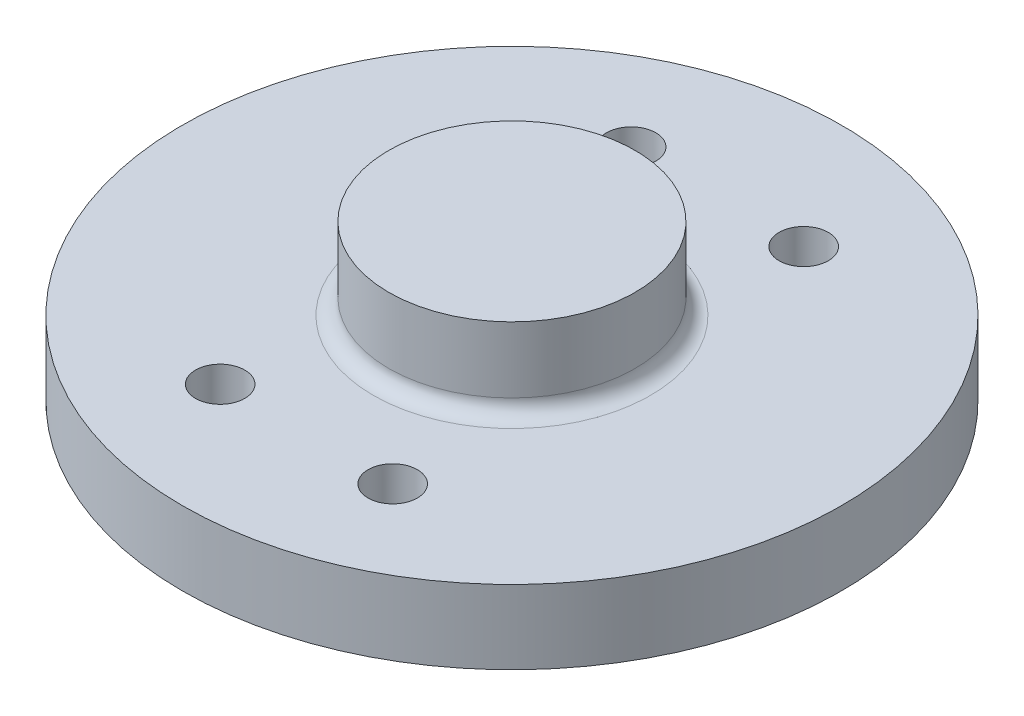
ISO-10303-21;
HEADER;
FILE_DESCRIPTION(('STEP AP214'),'2;1');
FILE_NAME('part.step','',(''),(''),'','','');
FILE_SCHEMA(('AUTOMOTIVE_DESIGN { 1 0 10303 214 1 1 1 1 }'));
ENDSEC;
DATA;
#1=APPLICATION_CONTEXT('core data for automotive mechanical design processes');
#2=APPLICATION_PROTOCOL_DEFINITION('international standard','automotive_design',2000,#1);
#3=PRODUCT_CONTEXT('',#1,'mechanical');
#4=PRODUCT('Part','Part','',(#3));
#5=PRODUCT_RELATED_PRODUCT_CATEGORY('part','',(#4));
#6=PRODUCT_DEFINITION_FORMATION('','',#4);
#7=PRODUCT_DEFINITION_CONTEXT('part definition',#1,'design');
#8=PRODUCT_DEFINITION('design','',#6,#7);
#9=PRODUCT_DEFINITION_SHAPE('','',#8);
#10=(LENGTH_UNIT() NAMED_UNIT(*) SI_UNIT(.MILLI.,.METRE.));
#11=(NAMED_UNIT(*) PLANE_ANGLE_UNIT() SI_UNIT($,.RADIAN.));
#12=(NAMED_UNIT(*) SI_UNIT($,.STERADIAN.) SOLID_ANGLE_UNIT());
#13=UNCERTAINTY_MEASURE_WITH_UNIT(LENGTH_MEASURE(1.E-05),#10,'distance_accuracy_value','');
#14=(GEOMETRIC_REPRESENTATION_CONTEXT(3) GLOBAL_UNCERTAINTY_ASSIGNED_CONTEXT((#13)) GLOBAL_UNIT_ASSIGNED_CONTEXT((#10,
#11,#12)) REPRESENTATION_CONTEXT('',''));
#15=CARTESIAN_POINT('',(0.,0.,0.));
#16=DIRECTION('',(0.,0.,1.));
#17=DIRECTION('',(1.,0.,0.));
#18=AXIS2_PLACEMENT_3D('',#15,#16,#17);
#19=CARTESIAN_POINT('',(0.,19.05,0.));
#20=DIRECTION('',(0.,-1.,0.));
#21=DIRECTION('',(0.,0.,-1.));
#22=AXIS2_PLACEMENT_3D('',#19,#20,#21);
#23=CYLINDRICAL_SURFACE('',#22,85.);
#24=CARTESIAN_POINT('',(0.,19.05,0.));
#25=DIRECTION('',(0.,1.,0.));
#26=DIRECTION('',(0.,0.,1.));
#27=AXIS2_PLACEMENT_3D('',#24,#25,#26);
#28=CIRCLE('',#27,85.);
#29=CARTESIAN_POINT('',(0.,19.05,85.));
#30=VERTEX_POINT('',#29);
#31=EDGE_CURVE('E46',#30,#30,#28,.T.);
#32=ORIENTED_EDGE('',*,*,#31,.F.);
#33=EDGE_LOOP('',(#32));
#34=FACE_BOUND('',#33,.T.);
#35=CARTESIAN_POINT('',(0.,0.,0.));
#36=DIRECTION('',(0.,1.,0.));
#37=DIRECTION('',(0.,0.,1.));
#38=AXIS2_PLACEMENT_3D('',#35,#36,#37);
#39=CIRCLE('',#38,85.);
#40=CARTESIAN_POINT('',(0.,0.,85.));
#41=VERTEX_POINT('',#40);
#42=EDGE_CURVE('E50',#41,#41,#39,.T.);
#43=ORIENTED_EDGE('',*,*,#42,.T.);
#44=EDGE_LOOP('',(#43));
#45=FACE_BOUND('',#44,.T.);
#46=ADVANCED_FACE('F35',(#34,#45),#23,.T.);
#47=CARTESIAN_POINT('',(0.,19.05,0.));
#48=DIRECTION('',(0.,1.,0.));
#49=DIRECTION('',(0.,0.,1.));
#50=AXIS2_PLACEMENT_3D('',#47,#48,#49);
#51=PLANE('',#50);
#52=CARTESIAN_POINT('',(-22.25,19.05,-53.));
#53=DIRECTION('',(0.,1.,0.));
#54=DIRECTION('',(0.,0.,-1.));
#55=AXIS2_PLACEMENT_3D('',#52,#53,#54);
#56=CIRCLE('',#55,6.35);
#57=CARTESIAN_POINT('',(-22.25,19.05,-59.35));
#58=VERTEX_POINT('',#57);
#59=EDGE_CURVE('E75',#58,#58,#56,.T.);
#60=ORIENTED_EDGE('',*,*,#59,.F.);
#61=EDGE_LOOP('',(#60));
#62=FACE_BOUND('',#61,.T.);
#63=CARTESIAN_POINT('',(22.25,19.05,-53.));
#64=DIRECTION('',(0.,1.,0.));
#65=DIRECTION('',(0.,0.,1.));
#66=AXIS2_PLACEMENT_3D('',#63,#64,#65);
#67=CIRCLE('',#66,6.35);
#68=CARTESIAN_POINT('',(22.25,19.05,-46.65));
#69=VERTEX_POINT('',#68);
#70=EDGE_CURVE('E68',#69,#69,#67,.T.);
#71=ORIENTED_EDGE('',*,*,#70,.F.);
#72=EDGE_LOOP('',(#71));
#73=FACE_BOUND('',#72,.T.);
#74=CARTESIAN_POINT('',(22.25,19.05,53.));
#75=DIRECTION('',(0.,1.,0.));
#76=DIRECTION('',(0.,0.,-1.));
#77=AXIS2_PLACEMENT_3D('',#74,#75,#76);
#78=CIRCLE('',#77,6.35);
#79=CARTESIAN_POINT('',(22.25,19.05,46.65));
#80=VERTEX_POINT('',#79);
#81=EDGE_CURVE('E69',#80,#80,#78,.T.);
#82=ORIENTED_EDGE('',*,*,#81,.F.);
#83=EDGE_LOOP('',(#82));
#84=FACE_BOUND('',#83,.T.);
#85=CARTESIAN_POINT('',(-22.25,19.05,53.));
#86=DIRECTION('',(0.,1.,0.));
#87=DIRECTION('',(0.,0.,1.));
#88=AXIS2_PLACEMENT_3D('',#85,#86,#87);
#89=CIRCLE('',#88,6.35);
#90=CARTESIAN_POINT('',(-22.25,19.05,59.35));
#91=VERTEX_POINT('',#90);
#92=EDGE_CURVE('E61',#91,#91,#89,.T.);
#93=ORIENTED_EDGE('',*,*,#92,.F.);
#94=EDGE_LOOP('',(#93));
#95=FACE_BOUND('',#94,.T.);
#96=CARTESIAN_POINT('',(0.,19.05,0.));
#97=DIRECTION('',(0.,1.,0.));
#98=DIRECTION('',(0.,0.,1.));
#99=AXIS2_PLACEMENT_3D('',#96,#97,#98);
#100=CIRCLE('',#99,35.75);
#101=CARTESIAN_POINT('',(0.,19.05,35.75));
#102=VERTEX_POINT('',#101);
#103=EDGE_CURVE('E10',#102,#102,#100,.F.);
#104=ORIENTED_EDGE('',*,*,#103,.T.);
#105=EDGE_LOOP('',(#104));
#106=FACE_BOUND('',#105,.T.);
#107=ORIENTED_EDGE('',*,*,#31,.T.);
#108=EDGE_LOOP('',(#107));
#109=FACE_BOUND('',#108,.T.);
#110=ADVANCED_FACE('F85',(#62,#73,#84,#95,#106,#109),#51,.T.);
#111=CARTESIAN_POINT('',(0.,0.,0.));
#112=DIRECTION('',(0.,1.,0.));
#113=DIRECTION('',(0.,0.,1.));
#114=AXIS2_PLACEMENT_3D('',#111,#112,#113);
#115=PLANE('',#114);
#116=CARTESIAN_POINT('',(-22.25,0.,-53.));
#117=DIRECTION('',(0.,1.,0.));
#118=DIRECTION('',(0.,0.,1.));
#119=AXIS2_PLACEMENT_3D('',#116,#117,#118);
#120=CIRCLE('',#119,6.35);
#121=CARTESIAN_POINT('',(-22.25,0.,-46.65));
#122=VERTEX_POINT('',#121);
#123=EDGE_CURVE('E64',#122,#122,#120,.F.);
#124=ORIENTED_EDGE('',*,*,#123,.F.);
#125=EDGE_LOOP('',(#124));
#126=FACE_BOUND('',#125,.T.);
#127=CARTESIAN_POINT('',(22.25,0.,-53.));
#128=DIRECTION('',(0.,1.,0.));
#129=DIRECTION('',(0.,0.,1.));
#130=AXIS2_PLACEMENT_3D('',#127,#128,#129);
#131=CIRCLE('',#130,6.35);
#132=CARTESIAN_POINT('',(22.25,0.,-46.65));
#133=VERTEX_POINT('',#132);
#134=EDGE_CURVE('E72',#133,#133,#131,.F.);
#135=ORIENTED_EDGE('',*,*,#134,.F.);
#136=EDGE_LOOP('',(#135));
#137=FACE_BOUND('',#136,.T.);
#138=CARTESIAN_POINT('',(22.25,0.,53.));
#139=DIRECTION('',(0.,1.,0.));
#140=DIRECTION('',(0.,0.,1.));
#141=AXIS2_PLACEMENT_3D('',#138,#139,#140);
#142=CIRCLE('',#141,6.35);
#143=CARTESIAN_POINT('',(22.25,0.,59.35));
#144=VERTEX_POINT('',#143);
#145=EDGE_CURVE('E65',#144,#144,#142,.F.);
#146=ORIENTED_EDGE('',*,*,#145,.F.);
#147=EDGE_LOOP('',(#146));
#148=FACE_BOUND('',#147,.T.);
#149=CARTESIAN_POINT('',(-22.25,0.,53.));
#150=DIRECTION('',(0.,1.,0.));
#151=DIRECTION('',(0.,0.,1.));
#152=AXIS2_PLACEMENT_3D('',#149,#150,#151);
#153=CIRCLE('',#152,6.35);
#154=CARTESIAN_POINT('',(-22.25,0.,59.35));
#155=VERTEX_POINT('',#154);
#156=EDGE_CURVE('E58',#155,#155,#153,.F.);
#157=ORIENTED_EDGE('',*,*,#156,.F.);
#158=EDGE_LOOP('',(#157));
#159=FACE_BOUND('',#158,.T.);
#160=ORIENTED_EDGE('',*,*,#42,.F.);
#161=EDGE_LOOP('',(#160));
#162=FACE_BOUND('',#161,.T.);
#163=ADVANCED_FACE('F88',(#126,#137,#148,#159,#162),#115,.F.);
#164=CARTESIAN_POINT('',(0.,40.05,0.));
#165=DIRECTION('',(0.,-1.,0.));
#166=DIRECTION('',(0.,0.,-1.));
#167=AXIS2_PLACEMENT_3D('',#164,#165,#166);
#168=CYLINDRICAL_SURFACE('',#167,31.75);
#169=CARTESIAN_POINT('',(0.,23.05,0.));
#170=DIRECTION('',(0.,1.,0.));
#171=DIRECTION('',(0.,0.,1.));
#172=AXIS2_PLACEMENT_3D('',#169,#170,#171);
#173=CIRCLE('',#172,31.75);
#174=CARTESIAN_POINT('',(0.,23.05,31.75));
#175=VERTEX_POINT('',#174);
#176=EDGE_CURVE('E42',#175,#175,#173,.T.);
#177=ORIENTED_EDGE('',*,*,#176,.T.);
#178=EDGE_LOOP('',(#177));
#179=FACE_BOUND('',#178,.T.);
#180=CARTESIAN_POINT('',(0.,40.05,0.));
#181=DIRECTION('',(0.,1.,0.));
#182=DIRECTION('',(0.,0.,1.));
#183=AXIS2_PLACEMENT_3D('',#180,#181,#182);
#184=CIRCLE('',#183,31.75);
#185=CARTESIAN_POINT('',(0.,40.05,31.75));
#186=VERTEX_POINT('',#185);
#187=EDGE_CURVE('E54',#186,#186,#184,.T.);
#188=ORIENTED_EDGE('',*,*,#187,.F.);
#189=EDGE_LOOP('',(#188));
#190=FACE_BOUND('',#189,.T.);
#191=ADVANCED_FACE('F103',(#179,#190),#168,.T.);
#192=CARTESIAN_POINT('',(0.,40.05,0.));
#193=DIRECTION('',(0.,1.,0.));
#194=DIRECTION('',(0.,0.,1.));
#195=AXIS2_PLACEMENT_3D('',#192,#193,#194);
#196=PLANE('',#195);
#197=ORIENTED_EDGE('',*,*,#187,.T.);
#198=EDGE_LOOP('',(#197));
#199=FACE_BOUND('',#198,.T.);
#200=ADVANCED_FACE('F109',(#199),#196,.T.);
#201=CARTESIAN_POINT('',(0.,23.05,0.));
#202=DIRECTION('',(0.,1.,0.));
#203=DIRECTION('',(0.,0.,1.));
#204=AXIS2_PLACEMENT_3D('',#201,#202,#203);
#205=TOROIDAL_SURFACE('',#204,35.75,4.);
#206=ORIENTED_EDGE('',*,*,#103,.F.);
#207=EDGE_LOOP('',(#206));
#208=FACE_BOUND('',#207,.T.);
#209=ORIENTED_EDGE('',*,*,#176,.F.);
#210=EDGE_LOOP('',(#209));
#211=FACE_BOUND('',#210,.T.);
#212=ADVANCED_FACE('F37',(#208,#211),#205,.F.);
#213=CARTESIAN_POINT('',(-22.25,-17.9605122421383,53.));
#214=DIRECTION('',(0.,1.,0.));
#215=DIRECTION('',(0.,0.,1.));
#216=AXIS2_PLACEMENT_3D('',#213,#214,#215);
#217=CYLINDRICAL_SURFACE('',#216,6.35);
#218=ORIENTED_EDGE('',*,*,#156,.T.);
#219=EDGE_LOOP('',(#218));
#220=FACE_BOUND('',#219,.T.);
#221=ORIENTED_EDGE('',*,*,#92,.T.);
#222=EDGE_LOOP('',(#221));
#223=FACE_BOUND('',#222,.T.);
#224=ADVANCED_FACE('F117',(#220,#223),#217,.F.);
#225=CARTESIAN_POINT('',(22.25,-17.9605122421383,53.));
#226=DIRECTION('',(0.,1.,0.));
#227=DIRECTION('',(0.,0.,1.));
#228=AXIS2_PLACEMENT_3D('',#225,#226,#227);
#229=CYLINDRICAL_SURFACE('',#228,6.35);
#230=ORIENTED_EDGE('',*,*,#145,.T.);
#231=EDGE_LOOP('',(#230));
#232=FACE_BOUND('',#231,.T.);
#233=ORIENTED_EDGE('',*,*,#81,.T.);
#234=EDGE_LOOP('',(#233));
#235=FACE_BOUND('',#234,.T.);
#236=ADVANCED_FACE('F120',(#232,#235),#229,.F.);
#237=CARTESIAN_POINT('',(22.25,-17.9605122421383,-53.));
#238=DIRECTION('',(0.,1.,0.));
#239=DIRECTION('',(0.,0.,1.));
#240=AXIS2_PLACEMENT_3D('',#237,#238,#239);
#241=CYLINDRICAL_SURFACE('',#240,6.35);
#242=ORIENTED_EDGE('',*,*,#134,.T.);
#243=EDGE_LOOP('',(#242));
#244=FACE_BOUND('',#243,.T.);
#245=ORIENTED_EDGE('',*,*,#70,.T.);
#246=EDGE_LOOP('',(#245));
#247=FACE_BOUND('',#246,.T.);
#248=ADVANCED_FACE('F124',(#244,#247),#241,.F.);
#249=CARTESIAN_POINT('',(-22.25,-17.9605122421383,-53.));
#250=DIRECTION('',(0.,1.,0.));
#251=DIRECTION('',(0.,0.,1.));
#252=AXIS2_PLACEMENT_3D('',#249,#250,#251);
#253=CYLINDRICAL_SURFACE('',#252,6.35);
#254=ORIENTED_EDGE('',*,*,#123,.T.);
#255=EDGE_LOOP('',(#254));
#256=FACE_BOUND('',#255,.T.);
#257=ORIENTED_EDGE('',*,*,#59,.T.);
#258=EDGE_LOOP('',(#257));
#259=FACE_BOUND('',#258,.T.);
#260=ADVANCED_FACE('F83',(#256,#259),#253,.F.);
#261=CLOSED_SHELL('',(#46,#110,#163,#191,#200,#212,#224,#236,#248,#260));
#262=MANIFOLD_SOLID_BREP('B2',#261);
#263=ADVANCED_BREP_SHAPE_REPRESENTATION('',(#18,#262),#14);
#264=SHAPE_DEFINITION_REPRESENTATION(#9,#263);
ENDSEC;
END-ISO-10303-21;
